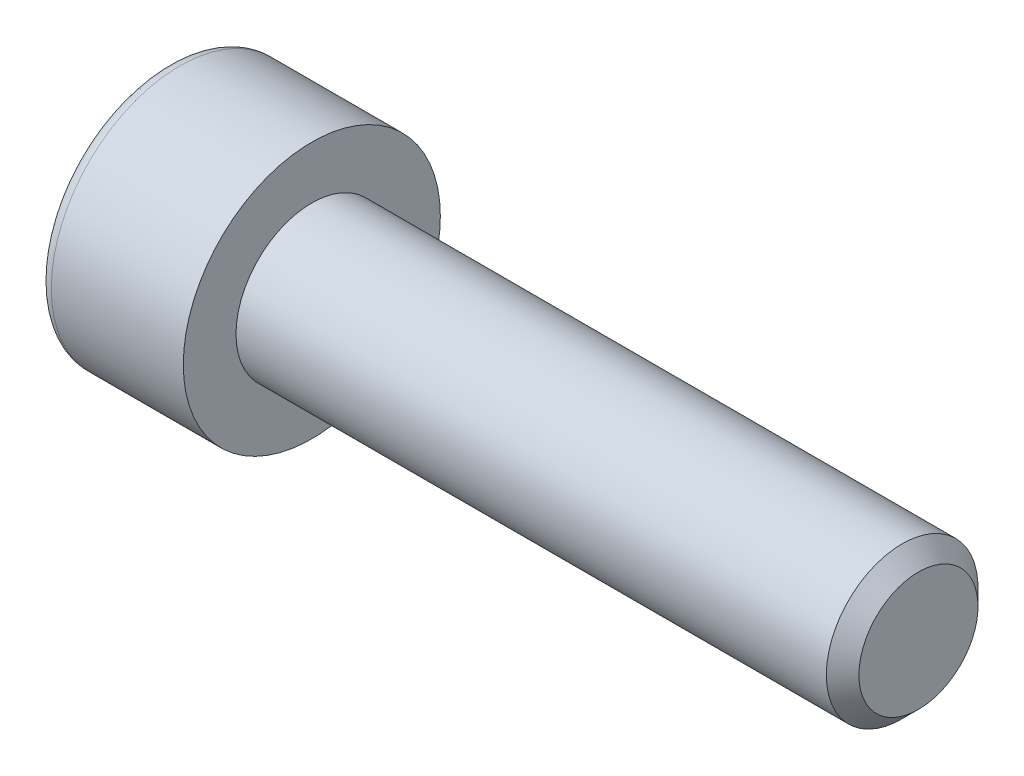
ISO-10303-21;
HEADER;
FILE_DESCRIPTION(('STEP AP214'),'2;1');
FILE_NAME('part.step','',(''),(''),'','','');
FILE_SCHEMA(('AUTOMOTIVE_DESIGN { 1 0 10303 214 1 1 1 1 }'));
ENDSEC;
DATA;
#1=APPLICATION_CONTEXT('core data for automotive mechanical design processes');
#2=APPLICATION_PROTOCOL_DEFINITION('international standard','automotive_design',2000,#1);
#3=PRODUCT_CONTEXT('',#1,'mechanical');
#4=PRODUCT('Part','Part','',(#3));
#5=PRODUCT_RELATED_PRODUCT_CATEGORY('part','',(#4));
#6=PRODUCT_DEFINITION_FORMATION('','',#4);
#7=PRODUCT_DEFINITION_CONTEXT('part definition',#1,'design');
#8=PRODUCT_DEFINITION('design','',#6,#7);
#9=PRODUCT_DEFINITION_SHAPE('','',#8);
#10=(LENGTH_UNIT() NAMED_UNIT(*) SI_UNIT(.MILLI.,.METRE.));
#11=(NAMED_UNIT(*) PLANE_ANGLE_UNIT() SI_UNIT($,.RADIAN.));
#12=(NAMED_UNIT(*) SI_UNIT($,.STERADIAN.) SOLID_ANGLE_UNIT());
#13=UNCERTAINTY_MEASURE_WITH_UNIT(LENGTH_MEASURE(1.E-05),#10,'distance_accuracy_value','');
#14=(GEOMETRIC_REPRESENTATION_CONTEXT(3) GLOBAL_UNCERTAINTY_ASSIGNED_CONTEXT((#13)) GLOBAL_UNIT_ASSIGNED_CONTEXT((#10,
#11,#12)) REPRESENTATION_CONTEXT('',''));
#15=CARTESIAN_POINT('',(0.,0.,0.));
#16=DIRECTION('',(0.,0.,1.));
#17=DIRECTION('',(1.,0.,0.));
#18=AXIS2_PLACEMENT_3D('',#15,#16,#17);
#19=CARTESIAN_POINT('',(0.,0.,0.));
#20=DIRECTION('',(-1.,0.,0.));
#21=DIRECTION('',(0.,0.,1.));
#22=AXIS2_PLACEMENT_3D('',#19,#20,#21);
#23=PLANE('',#22);
#24=CARTESIAN_POINT('',(0.,0.,0.));
#25=DIRECTION('',(-1.,0.,0.));
#26=DIRECTION('',(0.,0.,1.));
#27=AXIS2_PLACEMENT_3D('',#24,#25,#26);
#28=CIRCLE('',#27,3.39);
#29=CARTESIAN_POINT('',(0.,0.,3.39));
#30=VERTEX_POINT('',#29);
#31=EDGE_CURVE('E108',#30,#30,#28,.T.);
#32=ORIENTED_EDGE('',*,*,#31,.F.);
#33=EDGE_LOOP('',(#32));
#34=FACE_BOUND('',#33,.T.);
#35=CARTESIAN_POINT('',(0.,0.,0.));
#36=DIRECTION('',(-1.,0.,0.));
#37=DIRECTION('',(0.,0.,1.));
#38=AXIS2_PLACEMENT_3D('',#35,#36,#37);
#39=CIRCLE('',#38,2.);
#40=CARTESIAN_POINT('',(0.,0.,2.));
#41=VERTEX_POINT('',#40);
#42=EDGE_CURVE('E11',#41,#41,#39,.F.);
#43=ORIENTED_EDGE('',*,*,#42,.F.);
#44=EDGE_LOOP('',(#43));
#45=FACE_BOUND('',#44,.T.);
#46=ADVANCED_FACE('F16',(#34,#45),#23,.F.);
#47=CARTESIAN_POINT('',(-3.82,3.051,0.));
#48=DIRECTION('',(1.,0.,0.));
#49=DIRECTION('',(0.,0.,-1.));
#50=AXIS2_PLACEMENT_3D('',#47,#48,#49);
#51=PLANE('',#50);
#52=CARTESIAN_POINT('',(-3.82,0.,0.));
#53=DIRECTION('',(-1.,0.,0.));
#54=DIRECTION('',(0.,0.,1.));
#55=AXIS2_PLACEMENT_3D('',#52,#53,#54);
#56=CIRCLE('',#55,3.051);
#57=CARTESIAN_POINT('',(-3.82,0.,3.051));
#58=VERTEX_POINT('',#57);
#59=EDGE_CURVE('E91',#58,#58,#56,.T.);
#60=ORIENTED_EDGE('',*,*,#59,.T.);
#61=EDGE_LOOP('',(#60));
#62=FACE_BOUND('',#61,.T.);
#63=DIRECTION('',(0.,0.5,0.866025403784439));
#64=VECTOR('',#63,1.);
#65=CARTESIAN_POINT('',(-3.82,-0.536288105676657,2.07112175347316));
#66=LINE('',#65,#64);
#67=CARTESIAN_POINT('',(-3.82,-1.73205080756888,0.));
#68=VERTEX_POINT('',#67);
#69=CARTESIAN_POINT('',(-3.82,-0.866025403784438,1.5));
#70=VERTEX_POINT('',#69);
#71=EDGE_CURVE('E25',#68,#70,#66,.T.);
#72=ORIENTED_EDGE('',*,*,#71,.F.);
#73=DIRECTION('',(0.,-0.5,0.866025403784439));
#74=VECTOR('',#73,1.);
#75=CARTESIAN_POINT('',(-3.82,-0.536288105676658,-2.07112175347316));
#76=LINE('',#75,#74);
#77=CARTESIAN_POINT('',(-3.82,-0.866025403784439,-1.5));
#78=VERTEX_POINT('',#77);
#79=EDGE_CURVE('E40',#78,#68,#76,.T.);
#80=ORIENTED_EDGE('',*,*,#79,.F.);
#81=DIRECTION('',(0.,-1.,0.));
#82=VECTOR('',#81,1.);
#83=CARTESIAN_POINT('',(-3.82,3.051,-1.5));
#84=LINE('',#83,#82);
#85=CARTESIAN_POINT('',(-3.82,0.866025403784438,-1.5));
#86=VERTEX_POINT('',#85);
#87=EDGE_CURVE('E121',#86,#78,#84,.T.);
#88=ORIENTED_EDGE('',*,*,#87,.F.);
#89=DIRECTION('',(0.,-0.5,-0.866025403784439));
#90=VECTOR('',#89,1.);
#91=CARTESIAN_POINT('',(-3.82,2.06178810567666,0.571121753473161));
#92=LINE('',#91,#90);
#93=CARTESIAN_POINT('',(-3.82,1.73205080756887,0.));
#94=VERTEX_POINT('',#93);
#95=EDGE_CURVE('E118',#94,#86,#92,.T.);
#96=ORIENTED_EDGE('',*,*,#95,.F.);
#97=DIRECTION('',(0.,0.5,-0.866025403784439));
#98=VECTOR('',#97,1.);
#99=CARTESIAN_POINT('',(-3.82,2.06178810567665,-0.571121753473161));
#100=LINE('',#99,#98);
#101=CARTESIAN_POINT('',(-3.82,0.866025403784439,1.5));
#102=VERTEX_POINT('',#101);
#103=EDGE_CURVE('E115',#102,#94,#100,.T.);
#104=ORIENTED_EDGE('',*,*,#103,.F.);
#105=DIRECTION('',(0.,1.,0.));
#106=VECTOR('',#105,1.);
#107=CARTESIAN_POINT('',(-3.82,3.051,1.5));
#108=LINE('',#107,#106);
#109=EDGE_CURVE('E112',#70,#102,#108,.T.);
#110=ORIENTED_EDGE('',*,*,#109,.F.);
#111=EDGE_LOOP('',(#72,#80,#88,#96,#104,#110));
#112=FACE_BOUND('',#111,.T.);
#113=ADVANCED_FACE('F18',(#62,#112),#51,.F.);
#114=CARTESIAN_POINT('',(-3.82,0.,0.));
#115=DIRECTION('',(-1.,0.,0.));
#116=DIRECTION('',(0.,0.,1.));
#117=AXIS2_PLACEMENT_3D('',#114,#115,#116);
#118=CYLINDRICAL_SURFACE('',#117,3.39);
#119=CARTESIAN_POINT('',(-3.481,0.,0.));
#120=DIRECTION('',(-1.,0.,0.));
#121=DIRECTION('',(0.,0.,1.));
#122=AXIS2_PLACEMENT_3D('',#119,#120,#121);
#123=CIRCLE('',#122,3.39);
#124=CARTESIAN_POINT('',(-3.481,0.,3.39));
#125=VERTEX_POINT('',#124);
#126=EDGE_CURVE('E98',#125,#125,#123,.T.);
#127=ORIENTED_EDGE('',*,*,#126,.F.);
#128=EDGE_LOOP('',(#127));
#129=FACE_BOUND('',#128,.T.);
#130=ORIENTED_EDGE('',*,*,#31,.T.);
#131=EDGE_LOOP('',(#130));
#132=FACE_BOUND('',#131,.T.);
#133=ADVANCED_FACE('F202',(#129,#132),#118,.T.);
#134=CARTESIAN_POINT('',(-3.481,0.,0.));
#135=DIRECTION('',(-1.,0.,0.));
#136=DIRECTION('',(0.,0.,1.));
#137=AXIS2_PLACEMENT_3D('',#134,#135,#136);
#138=TOROIDAL_SURFACE('',#137,3.051,0.339);
#139=ORIENTED_EDGE('',*,*,#59,.F.);
#140=EDGE_LOOP('',(#139));
#141=FACE_BOUND('',#140,.T.);
#142=ORIENTED_EDGE('',*,*,#126,.T.);
#143=EDGE_LOOP('',(#142));
#144=FACE_BOUND('',#143,.T.);
#145=ADVANCED_FACE('F209',(#141,#144),#138,.T.);
#146=CARTESIAN_POINT('',(-1.82,-0.866025403784437,1.5));
#147=DIRECTION('',(0.,0.866025403784439,-0.5));
#148=DIRECTION('',(0.,0.5,0.866025403784439));
#149=AXIS2_PLACEMENT_3D('',#146,#147,#148);
#150=PLANE('',#149);
#151=ORIENTED_EDGE('',*,*,#71,.T.);
#152=DIRECTION('',(-1.,0.,0.));
#153=VECTOR('',#152,1.);
#154=CARTESIAN_POINT('',(-1.82,-0.866025403784437,1.5));
#155=LINE('',#154,#153);
#156=CARTESIAN_POINT('',(-1.82,-0.866025403784437,1.5));
#157=VERTEX_POINT('',#156);
#158=EDGE_CURVE('E32',#157,#70,#155,.T.);
#159=ORIENTED_EDGE('',*,*,#158,.F.);
#160=DIRECTION('',(0.,-0.5,-0.866025403784438));
#161=VECTOR('',#160,1.);
#162=CARTESIAN_POINT('',(-1.82,-0.866025403784437,1.5));
#163=LINE('',#162,#161);
#164=CARTESIAN_POINT('',(-1.82,-1.73205080756888,0.));
#165=VERTEX_POINT('',#164);
#166=EDGE_CURVE('E76',#157,#165,#163,.T.);
#167=ORIENTED_EDGE('',*,*,#166,.T.);
#168=DIRECTION('',(-1.,0.,0.));
#169=VECTOR('',#168,1.);
#170=CARTESIAN_POINT('',(-1.82,-1.73205080756888,0.));
#171=LINE('',#170,#169);
#172=EDGE_CURVE('E84',#165,#68,#171,.T.);
#173=ORIENTED_EDGE('',*,*,#172,.T.);
#174=EDGE_LOOP('',(#151,#159,#167,#173));
#175=FACE_BOUND('',#174,.T.);
#176=ADVANCED_FACE('F83',(#175),#150,.T.);
#177=CARTESIAN_POINT('',(-1.82,-1.73205080756888,0.));
#178=DIRECTION('',(0.,0.866025403784439,0.5));
#179=DIRECTION('',(0.,-0.5,0.866025403784439));
#180=AXIS2_PLACEMENT_3D('',#177,#178,#179);
#181=PLANE('',#180);
#182=ORIENTED_EDGE('',*,*,#79,.T.);
#183=ORIENTED_EDGE('',*,*,#172,.F.);
#184=DIRECTION('',(0.,0.5,-0.866025403784439));
#185=VECTOR('',#184,1.);
#186=CARTESIAN_POINT('',(-1.82,-1.73205080756888,0.));
#187=LINE('',#186,#185);
#188=CARTESIAN_POINT('',(-1.82,-0.866025403784439,-1.5));
#189=VERTEX_POINT('',#188);
#190=EDGE_CURVE('E72',#165,#189,#187,.T.);
#191=ORIENTED_EDGE('',*,*,#190,.T.);
#192=DIRECTION('',(-1.,0.,0.));
#193=VECTOR('',#192,1.);
#194=CARTESIAN_POINT('',(-1.82,-0.866025403784439,-1.5));
#195=LINE('',#194,#193);
#196=EDGE_CURVE('E92',#189,#78,#195,.T.);
#197=ORIENTED_EDGE('',*,*,#196,.T.);
#198=EDGE_LOOP('',(#182,#183,#191,#197));
#199=FACE_BOUND('',#198,.T.);
#200=ADVANCED_FACE('F89',(#199),#181,.T.);
#201=CARTESIAN_POINT('',(-1.82,-0.866025403784439,-1.5));
#202=DIRECTION('',(0.,0.,1.));
#203=DIRECTION('',(0.,-1.,0.));
#204=AXIS2_PLACEMENT_3D('',#201,#202,#203);
#205=PLANE('',#204);
#206=ORIENTED_EDGE('',*,*,#87,.T.);
#207=ORIENTED_EDGE('',*,*,#196,.F.);
#208=DIRECTION('',(0.,1.,0.));
#209=VECTOR('',#208,1.);
#210=CARTESIAN_POINT('',(-1.82,-0.866025403784439,-1.5));
#211=LINE('',#210,#209);
#212=CARTESIAN_POINT('',(-1.82,0.866025403784438,-1.5));
#213=VERTEX_POINT('',#212);
#214=EDGE_CURVE('E78',#189,#213,#211,.T.);
#215=ORIENTED_EDGE('',*,*,#214,.T.);
#216=DIRECTION('',(-1.,0.,0.));
#217=VECTOR('',#216,1.);
#218=CARTESIAN_POINT('',(-1.82,0.866025403784438,-1.5));
#219=LINE('',#218,#217);
#220=EDGE_CURVE('E101',#213,#86,#219,.T.);
#221=ORIENTED_EDGE('',*,*,#220,.T.);
#222=EDGE_LOOP('',(#206,#207,#215,#221));
#223=FACE_BOUND('',#222,.T.);
#224=ADVANCED_FACE('F160',(#223),#205,.T.);
#225=CARTESIAN_POINT('',(-1.82,0.866025403784438,-1.5));
#226=DIRECTION('',(0.,-0.866025403784439,0.5));
#227=DIRECTION('',(0.,-0.5,-0.866025403784439));
#228=AXIS2_PLACEMENT_3D('',#225,#226,#227);
#229=PLANE('',#228);
#230=ORIENTED_EDGE('',*,*,#95,.T.);
#231=ORIENTED_EDGE('',*,*,#220,.F.);
#232=DIRECTION('',(0.,0.5,0.866025403784439));
#233=VECTOR('',#232,1.);
#234=CARTESIAN_POINT('',(-1.82,0.866025403784438,-1.5));
#235=LINE('',#234,#233);
#236=CARTESIAN_POINT('',(-1.82,1.73205080756887,0.));
#237=VERTEX_POINT('',#236);
#238=EDGE_CURVE('E163',#213,#237,#235,.T.);
#239=ORIENTED_EDGE('',*,*,#238,.T.);
#240=DIRECTION('',(-1.,0.,0.));
#241=VECTOR('',#240,1.);
#242=CARTESIAN_POINT('',(-1.82,1.73205080756887,0.));
#243=LINE('',#242,#241);
#244=EDGE_CURVE('E142',#237,#94,#243,.T.);
#245=ORIENTED_EDGE('',*,*,#244,.T.);
#246=EDGE_LOOP('',(#230,#231,#239,#245));
#247=FACE_BOUND('',#246,.T.);
#248=ADVANCED_FACE('F162',(#247),#229,.T.);
#249=CARTESIAN_POINT('',(-1.82,1.73205080756888,0.));
#250=DIRECTION('',(0.,-0.866025403784439,-0.5));
#251=DIRECTION('',(0.,0.5,-0.866025403784439));
#252=AXIS2_PLACEMENT_3D('',#249,#250,#251);
#253=PLANE('',#252);
#254=ORIENTED_EDGE('',*,*,#103,.T.);
#255=ORIENTED_EDGE('',*,*,#244,.F.);
#256=DIRECTION('',(0.,-0.5,0.866025403784439));
#257=VECTOR('',#256,1.);
#258=CARTESIAN_POINT('',(-1.82,1.73205080756888,0.));
#259=LINE('',#258,#257);
#260=CARTESIAN_POINT('',(-1.82,0.866025403784439,1.5));
#261=VERTEX_POINT('',#260);
#262=EDGE_CURVE('E140',#237,#261,#259,.T.);
#263=ORIENTED_EDGE('',*,*,#262,.T.);
#264=DIRECTION('',(-1.,0.,0.));
#265=VECTOR('',#264,1.);
#266=CARTESIAN_POINT('',(-1.82,0.866025403784439,1.5));
#267=LINE('',#266,#265);
#268=EDGE_CURVE('E134',#261,#102,#267,.T.);
#269=ORIENTED_EDGE('',*,*,#268,.T.);
#270=EDGE_LOOP('',(#254,#255,#263,#269));
#271=FACE_BOUND('',#270,.T.);
#272=ADVANCED_FACE('F136',(#271),#253,.T.);
#273=CARTESIAN_POINT('',(-1.82,0.86602540378444,1.5));
#274=DIRECTION('',(0.,0.,-1.));
#275=DIRECTION('',(0.,1.,0.));
#276=AXIS2_PLACEMENT_3D('',#273,#274,#275);
#277=PLANE('',#276);
#278=ORIENTED_EDGE('',*,*,#109,.T.);
#279=ORIENTED_EDGE('',*,*,#268,.F.);
#280=DIRECTION('',(0.,-1.,0.));
#281=VECTOR('',#280,1.);
#282=CARTESIAN_POINT('',(-1.82,0.86602540378444,1.5));
#283=LINE('',#282,#281);
#284=EDGE_CURVE('E150',#261,#157,#283,.T.);
#285=ORIENTED_EDGE('',*,*,#284,.T.);
#286=ORIENTED_EDGE('',*,*,#158,.T.);
#287=EDGE_LOOP('',(#278,#279,#285,#286));
#288=FACE_BOUND('',#287,.T.);
#289=ADVANCED_FACE('F133',(#288),#277,.T.);
#290=CARTESIAN_POINT('',(-1.82,-1.73205080756888,0.));
#291=DIRECTION('',(1.,0.,0.));
#292=DIRECTION('',(0.,0.,1.));
#293=AXIS2_PLACEMENT_3D('',#290,#291,#292);
#294=PLANE('',#293);
#295=ORIENTED_EDGE('',*,*,#166,.F.);
#296=ORIENTED_EDGE('',*,*,#284,.F.);
#297=ORIENTED_EDGE('',*,*,#262,.F.);
#298=ORIENTED_EDGE('',*,*,#238,.F.);
#299=ORIENTED_EDGE('',*,*,#214,.F.);
#300=ORIENTED_EDGE('',*,*,#190,.F.);
#301=EDGE_LOOP('',(#295,#296,#297,#298,#299,#300));
#302=FACE_BOUND('',#301,.T.);
#303=ADVANCED_FACE('F74',(#302),#294,.F.);
#304=CARTESIAN_POINT('',(0.,0.,0.));
#305=DIRECTION('',(-1.,0.,0.));
#306=DIRECTION('',(0.,0.,1.));
#307=AXIS2_PLACEMENT_3D('',#304,#305,#306);
#308=CYLINDRICAL_SURFACE('',#307,2.);
#309=CARTESIAN_POINT('',(15.5705,0.,0.));
#310=DIRECTION('',(-1.,0.,0.));
#311=DIRECTION('',(0.,0.,1.));
#312=AXIS2_PLACEMENT_3D('',#309,#310,#311);
#313=CIRCLE('',#312,2.);
#314=CARTESIAN_POINT('',(15.5705,0.,2.));
#315=VERTEX_POINT('',#314);
#316=EDGE_CURVE('E173',#315,#315,#313,.T.);
#317=ORIENTED_EDGE('',*,*,#316,.T.);
#318=EDGE_LOOP('',(#317));
#319=FACE_BOUND('',#318,.T.);
#320=ORIENTED_EDGE('',*,*,#42,.T.);
#321=EDGE_LOOP('',(#320));
#322=FACE_BOUND('',#321,.T.);
#323=ADVANCED_FACE('F179',(#319,#322),#308,.T.);
#324=CARTESIAN_POINT('',(16.,0.,0.));
#325=DIRECTION('',(-1.,0.,0.));
#326=DIRECTION('',(0.,0.,1.));
#327=AXIS2_PLACEMENT_3D('',#324,#325,#326);
#328=PLANE('',#327);
#329=CARTESIAN_POINT('',(16.,0.,0.));
#330=DIRECTION('',(-1.,0.,0.));
#331=DIRECTION('',(0.,0.,1.));
#332=AXIS2_PLACEMENT_3D('',#329,#330,#331);
#333=CIRCLE('',#332,1.5705);
#334=CARTESIAN_POINT('',(16.,0.,1.5705));
#335=VERTEX_POINT('',#334);
#336=EDGE_CURVE('E87',#335,#335,#333,.T.);
#337=ORIENTED_EDGE('',*,*,#336,.F.);
#338=EDGE_LOOP('',(#337));
#339=FACE_BOUND('',#338,.T.);
#340=ADVANCED_FACE('F185',(#339),#328,.F.);
#341=CARTESIAN_POINT('',(16.,0.,0.));
#342=DIRECTION('',(-1.,0.,0.));
#343=DIRECTION('',(0.,0.,1.));
#344=AXIS2_PLACEMENT_3D('',#341,#342,#343);
#345=CONICAL_SURFACE('',#344,1.5705,0.785398163397448);
#346=ORIENTED_EDGE('',*,*,#316,.F.);
#347=EDGE_LOOP('',(#346));
#348=FACE_BOUND('',#347,.T.);
#349=ORIENTED_EDGE('',*,*,#336,.T.);
#350=EDGE_LOOP('',(#349));
#351=FACE_BOUND('',#350,.T.);
#352=ADVANCED_FACE('F182',(#348,#351),#345,.T.);
#353=CLOSED_SHELL('',(#46,#113,#133,#145,#176,#200,#224,#248,#272,#289,#303,#323,#340,#352));
#354=MANIFOLD_SOLID_BREP('B1',#353);
#355=ADVANCED_BREP_SHAPE_REPRESENTATION('',(#18,#354),#14);
#356=SHAPE_DEFINITION_REPRESENTATION(#9,#355);
ENDSEC;
END-ISO-10303-21;
